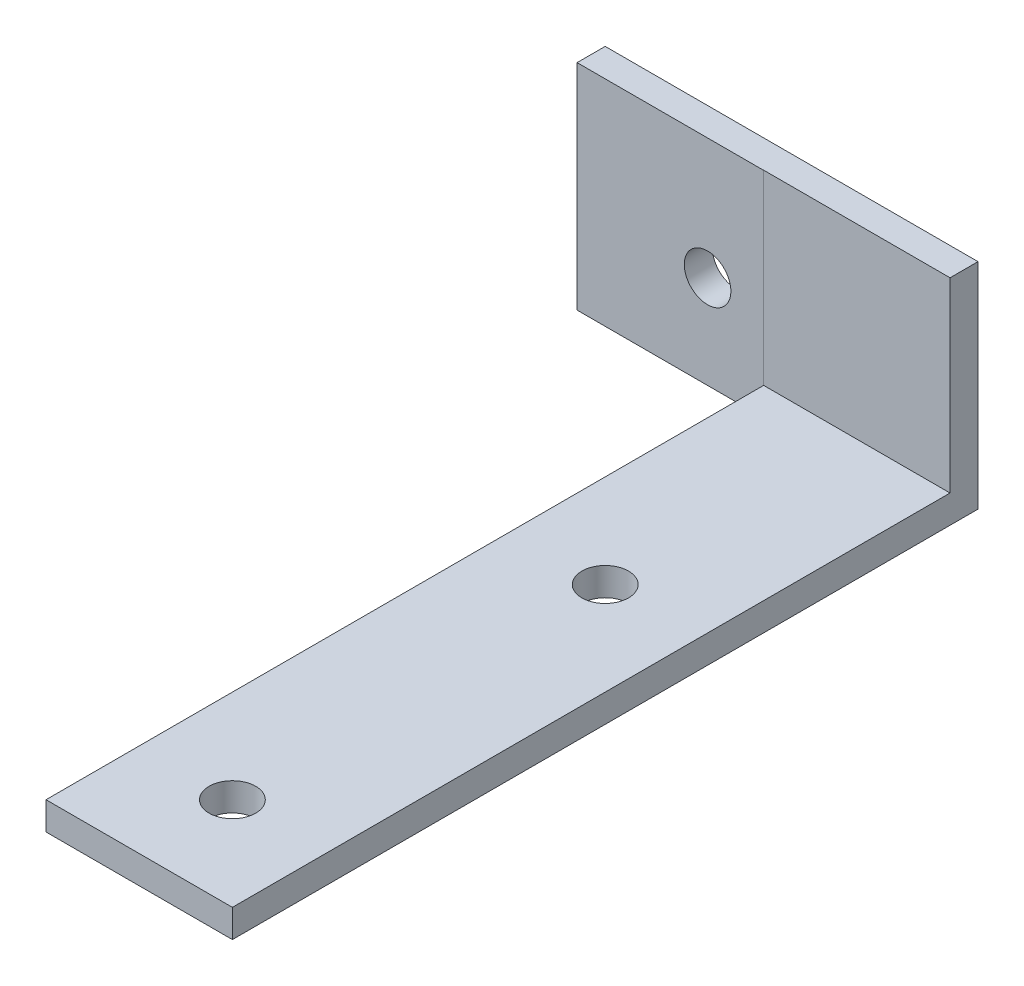
ISO-10303-21;
HEADER;
FILE_DESCRIPTION(('STEP AP214'),'2;1');
FILE_NAME('part.step','',(''),(''),'','','');
FILE_SCHEMA(('AUTOMOTIVE_DESIGN { 1 0 10303 214 1 1 1 1 }'));
ENDSEC;
DATA;
#1=APPLICATION_CONTEXT('core data for automotive mechanical design processes');
#2=APPLICATION_PROTOCOL_DEFINITION('international standard','automotive_design',2000,#1);
#3=PRODUCT_CONTEXT('',#1,'mechanical');
#4=PRODUCT('Part','Part','',(#3));
#5=PRODUCT_RELATED_PRODUCT_CATEGORY('part','',(#4));
#6=PRODUCT_DEFINITION_FORMATION('','',#4);
#7=PRODUCT_DEFINITION_CONTEXT('part definition',#1,'design');
#8=PRODUCT_DEFINITION('design','',#6,#7);
#9=PRODUCT_DEFINITION_SHAPE('','',#8);
#10=(LENGTH_UNIT() NAMED_UNIT(*) SI_UNIT(.MILLI.,.METRE.));
#11=(NAMED_UNIT(*) PLANE_ANGLE_UNIT() SI_UNIT($,.RADIAN.));
#12=(NAMED_UNIT(*) SI_UNIT($,.STERADIAN.) SOLID_ANGLE_UNIT());
#13=UNCERTAINTY_MEASURE_WITH_UNIT(LENGTH_MEASURE(1.E-05),#10,'distance_accuracy_value','');
#14=(GEOMETRIC_REPRESENTATION_CONTEXT(3) GLOBAL_UNCERTAINTY_ASSIGNED_CONTEXT((#13)) GLOBAL_UNIT_ASSIGNED_CONTEXT((#10,
#11,#12)) REPRESENTATION_CONTEXT('',''));
#15=CARTESIAN_POINT('',(0.,0.,0.));
#16=DIRECTION('',(0.,0.,1.));
#17=DIRECTION('',(1.,0.,0.));
#18=AXIS2_PLACEMENT_3D('',#15,#16,#17);
#19=CARTESIAN_POINT('',(-10.,3.,-40.));
#20=DIRECTION('',(1.,0.,0.));
#21=DIRECTION('',(0.,0.,-1.));
#22=AXIS2_PLACEMENT_3D('',#19,#20,#21);
#23=PLANE('',#22);
#24=DIRECTION('',(0.,1.,0.));
#25=VECTOR('',#24,1.);
#26=CARTESIAN_POINT('',(-10.,23.,-36.9846765094458));
#27=LINE('',#26,#25);
#28=CARTESIAN_POINT('',(-10.,0.,-36.9846765094458));
#29=VERTEX_POINT('',#28);
#30=CARTESIAN_POINT('',(-10.,3.,-36.9846765094458));
#31=VERTEX_POINT('',#30);
#32=EDGE_CURVE('E60',#29,#31,#27,.T.);
#33=ORIENTED_EDGE('',*,*,#32,.F.);
#34=DIRECTION('',(0.,0.,1.));
#35=VECTOR('',#34,1.);
#36=CARTESIAN_POINT('',(-10.,0.,-40.));
#37=LINE('',#36,#35);
#38=CARTESIAN_POINT('',(-9.99999999999999,0.,40.));
#39=VERTEX_POINT('',#38);
#40=EDGE_CURVE('E123',#29,#39,#37,.T.);
#41=ORIENTED_EDGE('',*,*,#40,.T.);
#42=DIRECTION('',(0.,-1.,0.));
#43=VECTOR('',#42,1.);
#44=CARTESIAN_POINT('',(-9.99999999999999,3.,40.));
#45=LINE('',#44,#43);
#46=CARTESIAN_POINT('',(-9.99999999999999,3.,40.));
#47=VERTEX_POINT('',#46);
#48=EDGE_CURVE('E53',#47,#39,#45,.T.);
#49=ORIENTED_EDGE('',*,*,#48,.F.);
#50=DIRECTION('',(0.,0.,1.));
#51=VECTOR('',#50,1.);
#52=CARTESIAN_POINT('',(-10.,3.,-40.));
#53=LINE('',#52,#51);
#54=EDGE_CURVE('E201',#31,#47,#53,.T.);
#55=ORIENTED_EDGE('',*,*,#54,.F.);
#56=EDGE_LOOP('',(#33,#41,#49,#55));
#57=FACE_BOUND('',#56,.T.);
#58=ADVANCED_FACE('F43',(#57),#23,.F.);
#59=CARTESIAN_POINT('',(0.,3.,0.));
#60=DIRECTION('',(0.,1.,0.));
#61=DIRECTION('',(0.,0.,1.));
#62=AXIS2_PLACEMENT_3D('',#59,#60,#61);
#63=PLANE('',#62);
#64=DIRECTION('',(1.,0.,0.));
#65=VECTOR('',#64,1.);
#66=CARTESIAN_POINT('',(-10.,3.,-37.));
#67=LINE('',#66,#65);
#68=CARTESIAN_POINT('',(-10.,3.,-37.));
#69=VERTEX_POINT('',#68);
#70=CARTESIAN_POINT('',(10.,3.,-37.));
#71=VERTEX_POINT('',#70);
#72=EDGE_CURVE('E68',#69,#71,#67,.T.);
#73=ORIENTED_EDGE('',*,*,#72,.F.);
#74=EDGE_CURVE('E203',#69,#31,#53,.T.);
#75=ORIENTED_EDGE('',*,*,#74,.T.);
#76=ORIENTED_EDGE('',*,*,#54,.T.);
#77=DIRECTION('',(1.,0.,0.));
#78=VECTOR('',#77,1.);
#79=CARTESIAN_POINT('',(-9.99999999999999,3.,40.));
#80=LINE('',#79,#78);
#81=CARTESIAN_POINT('',(10.,3.,40.));
#82=VERTEX_POINT('',#81);
#83=EDGE_CURVE('E206',#47,#82,#80,.T.);
#84=ORIENTED_EDGE('',*,*,#83,.T.);
#85=DIRECTION('',(0.,0.,-1.));
#86=VECTOR('',#85,1.);
#87=CARTESIAN_POINT('',(10.,3.,-40.));
#88=LINE('',#87,#86);
#89=EDGE_CURVE('E198',#82,#71,#88,.T.);
#90=ORIENTED_EDGE('',*,*,#89,.T.);
#91=EDGE_LOOP('',(#73,#75,#76,#84,#90));
#92=FACE_BOUND('',#91,.T.);
#93=CARTESIAN_POINT('',(0.,3.,30.));
#94=DIRECTION('',(0.,1.,0.));
#95=DIRECTION('',(0.,0.,1.));
#96=AXIS2_PLACEMENT_3D('',#93,#94,#95);
#97=CIRCLE('',#96,2.5);
#98=CARTESIAN_POINT('',(0.,3.,32.5));
#99=VERTEX_POINT('',#98);
#100=EDGE_CURVE('E191',#99,#99,#97,.T.);
#101=ORIENTED_EDGE('',*,*,#100,.F.);
#102=EDGE_LOOP('',(#101));
#103=FACE_BOUND('',#102,.T.);
#104=CARTESIAN_POINT('',(0.,3.,-10.));
#105=DIRECTION('',(0.,1.,0.));
#106=DIRECTION('',(0.,0.,1.));
#107=AXIS2_PLACEMENT_3D('',#104,#105,#106);
#108=CIRCLE('',#107,2.5);
#109=CARTESIAN_POINT('',(0.,3.,-7.5));
#110=VERTEX_POINT('',#109);
#111=EDGE_CURVE('E183',#110,#110,#108,.T.);
#112=ORIENTED_EDGE('',*,*,#111,.F.);
#113=EDGE_LOOP('',(#112));
#114=FACE_BOUND('',#113,.T.);
#115=ADVANCED_FACE('F231',(#92,#103,#114),#63,.T.);
#116=CARTESIAN_POINT('',(0.,0.,0.));
#117=DIRECTION('',(0.,1.,0.));
#118=DIRECTION('',(0.,0.,1.));
#119=AXIS2_PLACEMENT_3D('',#116,#117,#118);
#120=PLANE('',#119);
#121=DIRECTION('',(0.,0.,-1.));
#122=VECTOR('',#121,1.);
#123=CARTESIAN_POINT('',(10.,0.,-40.));
#124=LINE('',#123,#122);
#125=CARTESIAN_POINT('',(10.,0.,40.));
#126=VERTEX_POINT('',#125);
#127=CARTESIAN_POINT('',(10.,0.,-40.));
#128=VERTEX_POINT('',#127);
#129=EDGE_CURVE('E124',#126,#128,#124,.T.);
#130=ORIENTED_EDGE('',*,*,#129,.F.);
#131=DIRECTION('',(1.,0.,0.));
#132=VECTOR('',#131,1.);
#133=CARTESIAN_POINT('',(-9.99999999999999,0.,40.));
#134=LINE('',#133,#132);
#135=EDGE_CURVE('E202',#39,#126,#134,.T.);
#136=ORIENTED_EDGE('',*,*,#135,.F.);
#137=ORIENTED_EDGE('',*,*,#40,.F.);
#138=DIRECTION('',(1.,0.,0.));
#139=VECTOR('',#138,1.);
#140=CARTESIAN_POINT('',(-30.,0.,-36.9846765094458));
#141=LINE('',#140,#139);
#142=CARTESIAN_POINT('',(-30.,0.,-36.9846765094458));
#143=VERTEX_POINT('',#142);
#144=EDGE_CURVE('E131',#143,#29,#141,.T.);
#145=ORIENTED_EDGE('',*,*,#144,.F.);
#146=DIRECTION('',(0.,0.,1.));
#147=VECTOR('',#146,1.);
#148=CARTESIAN_POINT('',(-30.,0.,-40.));
#149=LINE('',#148,#147);
#150=CARTESIAN_POINT('',(-30.,0.,-40.));
#151=VERTEX_POINT('',#150);
#152=EDGE_CURVE('E127',#151,#143,#149,.T.);
#153=ORIENTED_EDGE('',*,*,#152,.F.);
#154=DIRECTION('',(-1.,0.,0.));
#155=VECTOR('',#154,1.);
#156=CARTESIAN_POINT('',(-10.,0.,-40.));
#157=LINE('',#156,#155);
#158=EDGE_CURVE('E113',#128,#151,#157,.T.);
#159=ORIENTED_EDGE('',*,*,#158,.F.);
#160=EDGE_LOOP('',(#130,#136,#137,#145,#153,#159));
#161=FACE_BOUND('',#160,.T.);
#162=CARTESIAN_POINT('',(0.,0.,30.));
#163=DIRECTION('',(0.,1.,0.));
#164=DIRECTION('',(0.,0.,1.));
#165=AXIS2_PLACEMENT_3D('',#162,#163,#164);
#166=CIRCLE('',#165,2.5);
#167=CARTESIAN_POINT('',(0.,0.,32.5));
#168=VERTEX_POINT('',#167);
#169=EDGE_CURVE('E187',#168,#168,#166,.T.);
#170=ORIENTED_EDGE('',*,*,#169,.T.);
#171=EDGE_LOOP('',(#170));
#172=FACE_BOUND('',#171,.T.);
#173=CARTESIAN_POINT('',(0.,0.,-10.));
#174=DIRECTION('',(0.,1.,0.));
#175=DIRECTION('',(0.,0.,1.));
#176=AXIS2_PLACEMENT_3D('',#173,#174,#175);
#177=CIRCLE('',#176,2.5);
#178=CARTESIAN_POINT('',(0.,0.,-7.5));
#179=VERTEX_POINT('',#178);
#180=EDGE_CURVE('E182',#179,#179,#177,.T.);
#181=ORIENTED_EDGE('',*,*,#180,.T.);
#182=EDGE_LOOP('',(#181));
#183=FACE_BOUND('',#182,.T.);
#184=ADVANCED_FACE('F128',(#161,#172,#183),#120,.F.);
#185=CARTESIAN_POINT('',(10.,3.,-40.));
#186=DIRECTION('',(-1.,0.,0.));
#187=DIRECTION('',(0.,0.,1.));
#188=AXIS2_PLACEMENT_3D('',#185,#186,#187);
#189=PLANE('',#188);
#190=ORIENTED_EDGE('',*,*,#129,.T.);
#191=DIRECTION('',(0.,-1.,0.));
#192=VECTOR('',#191,1.);
#193=CARTESIAN_POINT('',(10.,3.,-40.));
#194=LINE('',#193,#192);
#195=CARTESIAN_POINT('',(10.,23.,-40.));
#196=VERTEX_POINT('',#195);
#197=EDGE_CURVE('E11',#196,#128,#194,.T.);
#198=ORIENTED_EDGE('',*,*,#197,.F.);
#199=DIRECTION('',(0.,0.,-1.));
#200=VECTOR('',#199,1.);
#201=CARTESIAN_POINT('',(10.,23.,-40.));
#202=LINE('',#201,#200);
#203=CARTESIAN_POINT('',(10.,23.,-37.));
#204=VERTEX_POINT('',#203);
#205=EDGE_CURVE('E166',#204,#196,#202,.T.);
#206=ORIENTED_EDGE('',*,*,#205,.F.);
#207=DIRECTION('',(0.,-1.,0.));
#208=VECTOR('',#207,1.);
#209=CARTESIAN_POINT('',(10.,23.,-37.));
#210=LINE('',#209,#208);
#211=EDGE_CURVE('E173',#204,#71,#210,.T.);
#212=ORIENTED_EDGE('',*,*,#211,.T.);
#213=ORIENTED_EDGE('',*,*,#89,.F.);
#214=DIRECTION('',(0.,-1.,0.));
#215=VECTOR('',#214,1.);
#216=CARTESIAN_POINT('',(10.,3.,40.));
#217=LINE('',#216,#215);
#218=EDGE_CURVE('E209',#82,#126,#217,.T.);
#219=ORIENTED_EDGE('',*,*,#218,.T.);
#220=EDGE_LOOP('',(#190,#198,#206,#212,#213,#219));
#221=FACE_BOUND('',#220,.T.);
#222=ADVANCED_FACE('F45',(#221),#189,.F.);
#223=CARTESIAN_POINT('',(-10.,3.,-40.));
#224=DIRECTION('',(0.,0.,1.));
#225=DIRECTION('',(1.,0.,0.));
#226=AXIS2_PLACEMENT_3D('',#223,#224,#225);
#227=PLANE('',#226);
#228=CARTESIAN_POINT('',(-16.,10.,-40.));
#229=DIRECTION('',(0.,0.,-1.));
#230=DIRECTION('',(-1.,0.,0.));
#231=AXIS2_PLACEMENT_3D('',#228,#229,#230);
#232=CIRCLE('',#231,2.5);
#233=CARTESIAN_POINT('',(-18.5,10.,-40.));
#234=VERTEX_POINT('',#233);
#235=EDGE_CURVE('E148',#234,#234,#232,.T.);
#236=ORIENTED_EDGE('',*,*,#235,.F.);
#237=EDGE_LOOP('',(#236));
#238=FACE_BOUND('',#237,.T.);
#239=ORIENTED_EDGE('',*,*,#158,.T.);
#240=DIRECTION('',(0.,-1.,0.));
#241=VECTOR('',#240,1.);
#242=CARTESIAN_POINT('',(-30.,23.,-40.));
#243=LINE('',#242,#241);
#244=CARTESIAN_POINT('',(-30.,23.,-40.));
#245=VERTEX_POINT('',#244);
#246=EDGE_CURVE('E118',#245,#151,#243,.T.);
#247=ORIENTED_EDGE('',*,*,#246,.F.);
#248=DIRECTION('',(-1.,0.,0.));
#249=VECTOR('',#248,1.);
#250=CARTESIAN_POINT('',(-10.,23.,-40.));
#251=LINE('',#250,#249);
#252=EDGE_CURVE('E170',#196,#245,#251,.T.);
#253=ORIENTED_EDGE('',*,*,#252,.F.);
#254=ORIENTED_EDGE('',*,*,#197,.T.);
#255=EDGE_LOOP('',(#239,#247,#253,#254));
#256=FACE_BOUND('',#255,.T.);
#257=ADVANCED_FACE('F115',(#238,#256),#227,.F.);
#258=CARTESIAN_POINT('',(-9.99999999999999,3.,40.));
#259=DIRECTION('',(0.,0.,-1.));
#260=DIRECTION('',(-1.,0.,0.));
#261=AXIS2_PLACEMENT_3D('',#258,#259,#260);
#262=PLANE('',#261);
#263=ORIENTED_EDGE('',*,*,#135,.T.);
#264=ORIENTED_EDGE('',*,*,#218,.F.);
#265=ORIENTED_EDGE('',*,*,#83,.F.);
#266=ORIENTED_EDGE('',*,*,#48,.T.);
#267=EDGE_LOOP('',(#263,#264,#265,#266));
#268=FACE_BOUND('',#267,.T.);
#269=ADVANCED_FACE('F225',(#268),#262,.F.);
#270=CARTESIAN_POINT('',(0.,3.,30.));
#271=DIRECTION('',(0.,-1.,0.));
#272=DIRECTION('',(0.,0.,-1.));
#273=AXIS2_PLACEMENT_3D('',#270,#271,#272);
#274=CYLINDRICAL_SURFACE('',#273,2.5);
#275=ORIENTED_EDGE('',*,*,#100,.T.);
#276=EDGE_LOOP('',(#275));
#277=FACE_BOUND('',#276,.T.);
#278=ORIENTED_EDGE('',*,*,#169,.F.);
#279=EDGE_LOOP('',(#278));
#280=FACE_BOUND('',#279,.T.);
#281=ADVANCED_FACE('F256',(#277,#280),#274,.F.);
#282=CARTESIAN_POINT('',(0.,3.,-10.));
#283=DIRECTION('',(0.,-1.,0.));
#284=DIRECTION('',(0.,0.,-1.));
#285=AXIS2_PLACEMENT_3D('',#282,#283,#284);
#286=CYLINDRICAL_SURFACE('',#285,2.5);
#287=ORIENTED_EDGE('',*,*,#111,.T.);
#288=EDGE_LOOP('',(#287));
#289=FACE_BOUND('',#288,.T.);
#290=ORIENTED_EDGE('',*,*,#180,.F.);
#291=EDGE_LOOP('',(#290));
#292=FACE_BOUND('',#291,.T.);
#293=ADVANCED_FACE('F278',(#289,#292),#286,.F.);
#294=CARTESIAN_POINT('',(-10.,23.,-37.));
#295=DIRECTION('',(0.,0.,-1.));
#296=DIRECTION('',(-1.,0.,0.));
#297=AXIS2_PLACEMENT_3D('',#294,#295,#296);
#298=PLANE('',#297);
#299=ORIENTED_EDGE('',*,*,#72,.T.);
#300=ORIENTED_EDGE('',*,*,#211,.F.);
#301=DIRECTION('',(1.,0.,0.));
#302=VECTOR('',#301,1.);
#303=CARTESIAN_POINT('',(-10.,23.,-37.));
#304=LINE('',#303,#302);
#305=CARTESIAN_POINT('',(-10.,23.,-37.));
#306=VERTEX_POINT('',#305);
#307=EDGE_CURVE('E163',#306,#204,#304,.T.);
#308=ORIENTED_EDGE('',*,*,#307,.F.);
#309=DIRECTION('',(0.,-1.,0.));
#310=VECTOR('',#309,1.);
#311=CARTESIAN_POINT('',(-10.,23.,-37.));
#312=LINE('',#311,#310);
#313=EDGE_CURVE('E179',#306,#69,#312,.T.);
#314=ORIENTED_EDGE('',*,*,#313,.T.);
#315=EDGE_LOOP('',(#299,#300,#308,#314));
#316=FACE_BOUND('',#315,.T.);
#317=ADVANCED_FACE('F234',(#316),#298,.F.);
#318=CARTESIAN_POINT('',(0.,23.,0.));
#319=DIRECTION('',(0.,1.,0.));
#320=DIRECTION('',(0.,0.,1.));
#321=AXIS2_PLACEMENT_3D('',#318,#319,#320);
#322=PLANE('',#321);
#323=ORIENTED_EDGE('',*,*,#252,.T.);
#324=DIRECTION('',(0.,0.,-1.));
#325=VECTOR('',#324,1.);
#326=CARTESIAN_POINT('',(-30.,23.,-40.));
#327=LINE('',#326,#325);
#328=CARTESIAN_POINT('',(-30.,23.,-36.9846765094458));
#329=VERTEX_POINT('',#328);
#330=EDGE_CURVE('E140',#329,#245,#327,.T.);
#331=ORIENTED_EDGE('',*,*,#330,.F.);
#332=DIRECTION('',(1.,0.,0.));
#333=VECTOR('',#332,1.);
#334=CARTESIAN_POINT('',(-30.,23.,-36.9846765094458));
#335=LINE('',#334,#333);
#336=CARTESIAN_POINT('',(-10.,23.,-36.9846765094458));
#337=VERTEX_POINT('',#336);
#338=EDGE_CURVE('E154',#329,#337,#335,.T.);
#339=ORIENTED_EDGE('',*,*,#338,.T.);
#340=DIRECTION('',(0.,0.,-1.));
#341=VECTOR('',#340,1.);
#342=CARTESIAN_POINT('',(-10.,23.,-40.));
#343=LINE('',#342,#341);
#344=EDGE_CURVE('E142',#337,#306,#343,.T.);
#345=ORIENTED_EDGE('',*,*,#344,.T.);
#346=ORIENTED_EDGE('',*,*,#307,.T.);
#347=ORIENTED_EDGE('',*,*,#205,.T.);
#348=EDGE_LOOP('',(#323,#331,#339,#345,#346,#347));
#349=FACE_BOUND('',#348,.T.);
#350=ADVANCED_FACE('F270',(#349),#322,.T.);
#351=CARTESIAN_POINT('',(-30.,23.,-36.9846765094458));
#352=DIRECTION('',(0.,0.,-1.));
#353=DIRECTION('',(0.,1.,0.));
#354=AXIS2_PLACEMENT_3D('',#351,#352,#353);
#355=PLANE('',#354);
#356=CARTESIAN_POINT('',(-16.,10.,-36.9846765094458));
#357=DIRECTION('',(0.,0.,-1.));
#358=DIRECTION('',(0.,1.,0.));
#359=AXIS2_PLACEMENT_3D('',#356,#357,#358);
#360=CIRCLE('',#359,2.5);
#361=CARTESIAN_POINT('',(-16.,12.5,-36.9846765094458));
#362=VERTEX_POINT('',#361);
#363=EDGE_CURVE('E47',#362,#362,#360,.T.);
#364=ORIENTED_EDGE('',*,*,#363,.T.);
#365=EDGE_LOOP('',(#364));
#366=FACE_BOUND('',#365,.T.);
#367=ORIENTED_EDGE('',*,*,#32,.T.);
#368=EDGE_CURVE('E156',#31,#337,#27,.T.);
#369=ORIENTED_EDGE('',*,*,#368,.T.);
#370=ORIENTED_EDGE('',*,*,#338,.F.);
#371=DIRECTION('',(0.,1.,0.));
#372=VECTOR('',#371,1.);
#373=CARTESIAN_POINT('',(-30.,23.,-36.9846765094458));
#374=LINE('',#373,#372);
#375=EDGE_CURVE('E135',#143,#329,#374,.T.);
#376=ORIENTED_EDGE('',*,*,#375,.F.);
#377=ORIENTED_EDGE('',*,*,#144,.T.);
#378=EDGE_LOOP('',(#367,#369,#370,#376,#377));
#379=FACE_BOUND('',#378,.T.);
#380=ADVANCED_FACE('F268',(#366,#379),#355,.F.);
#381=CARTESIAN_POINT('',(-30.,0.,0.));
#382=DIRECTION('',(-1.,0.,0.));
#383=DIRECTION('',(0.,0.,1.));
#384=AXIS2_PLACEMENT_3D('',#381,#382,#383);
#385=PLANE('',#384);
#386=ORIENTED_EDGE('',*,*,#246,.T.);
#387=ORIENTED_EDGE('',*,*,#152,.T.);
#388=ORIENTED_EDGE('',*,*,#375,.T.);
#389=ORIENTED_EDGE('',*,*,#330,.T.);
#390=EDGE_LOOP('',(#386,#387,#388,#389));
#391=FACE_BOUND('',#390,.T.);
#392=ADVANCED_FACE('F138',(#391),#385,.T.);
#393=CARTESIAN_POINT('',(-9.99999999999998,0.,0.));
#394=DIRECTION('',(-1.,0.,0.));
#395=DIRECTION('',(0.,0.,1.));
#396=AXIS2_PLACEMENT_3D('',#393,#394,#395);
#397=PLANE('',#396);
#398=ORIENTED_EDGE('',*,*,#74,.F.);
#399=ORIENTED_EDGE('',*,*,#313,.F.);
#400=ORIENTED_EDGE('',*,*,#344,.F.);
#401=ORIENTED_EDGE('',*,*,#368,.F.);
#402=EDGE_LOOP('',(#398,#399,#400,#401));
#403=FACE_BOUND('',#402,.T.);
#404=ADVANCED_FACE('F240',(#403),#397,.F.);
#405=CARTESIAN_POINT('',(-16.,10.,-20.));
#406=DIRECTION('',(0.,0.,-1.));
#407=DIRECTION('',(-1.,0.,0.));
#408=AXIS2_PLACEMENT_3D('',#405,#406,#407);
#409=CYLINDRICAL_SURFACE('',#408,2.5);
#410=ORIENTED_EDGE('',*,*,#235,.T.);
#411=EDGE_LOOP('',(#410));
#412=FACE_BOUND('',#411,.T.);
#413=ORIENTED_EDGE('',*,*,#363,.F.);
#414=EDGE_LOOP('',(#413));
#415=FACE_BOUND('',#414,.T.);
#416=ADVANCED_FACE('F398',(#412,#415),#409,.F.);
#417=CLOSED_SHELL('',(#58,#115,#184,#222,#257,#269,#281,#293,#317,#350,#380,#392,#404,#416));
#418=MANIFOLD_SOLID_BREP('B2',#417);
#419=ADVANCED_BREP_SHAPE_REPRESENTATION('',(#18,#418),#14);
#420=SHAPE_DEFINITION_REPRESENTATION(#9,#419);
ENDSEC;
END-ISO-10303-21;
